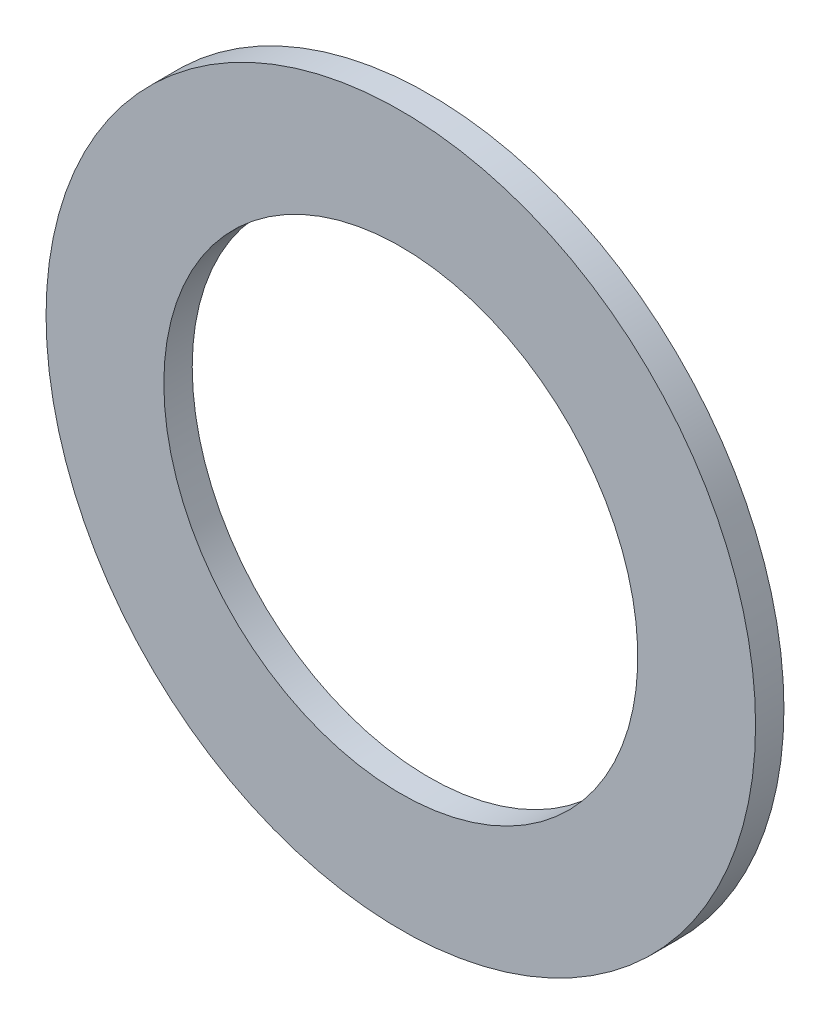
ISO-10303-21;
HEADER;
FILE_DESCRIPTION(('STEP AP214'),'2;1');
FILE_NAME('part.step','',(''),(''),'','','');
FILE_SCHEMA(('AUTOMOTIVE_DESIGN { 1 0 10303 214 1 1 1 1 }'));
ENDSEC;
DATA;
#1=APPLICATION_CONTEXT('core data for automotive mechanical design processes');
#2=APPLICATION_PROTOCOL_DEFINITION('international standard','automotive_design',2000,#1);
#3=PRODUCT_CONTEXT('',#1,'mechanical');
#4=PRODUCT('Part','Part','',(#3));
#5=PRODUCT_RELATED_PRODUCT_CATEGORY('part','',(#4));
#6=PRODUCT_DEFINITION_FORMATION('','',#4);
#7=PRODUCT_DEFINITION_CONTEXT('part definition',#1,'design');
#8=PRODUCT_DEFINITION('design','',#6,#7);
#9=PRODUCT_DEFINITION_SHAPE('','',#8);
#10=(LENGTH_UNIT() NAMED_UNIT(*) SI_UNIT(.MILLI.,.METRE.));
#11=(NAMED_UNIT(*) PLANE_ANGLE_UNIT() SI_UNIT($,.RADIAN.));
#12=(NAMED_UNIT(*) SI_UNIT($,.STERADIAN.) SOLID_ANGLE_UNIT());
#13=UNCERTAINTY_MEASURE_WITH_UNIT(LENGTH_MEASURE(1.E-05),#10,'distance_accuracy_value','');
#14=(GEOMETRIC_REPRESENTATION_CONTEXT(3) GLOBAL_UNCERTAINTY_ASSIGNED_CONTEXT((#13)) GLOBAL_UNIT_ASSIGNED_CONTEXT((#10,
#11,#12)) REPRESENTATION_CONTEXT('',''));
#15=CARTESIAN_POINT('',(0.,0.,0.));
#16=DIRECTION('',(0.,0.,1.));
#17=DIRECTION('',(1.,0.,0.));
#18=AXIS2_PLACEMENT_3D('',#15,#16,#17);
#19=CARTESIAN_POINT('',(0.,0.,-0.381));
#20=DIRECTION('',(0.,0.,1.));
#21=DIRECTION('',(1.,0.,0.));
#22=AXIS2_PLACEMENT_3D('',#19,#20,#21);
#23=PLANE('',#22);
#24=CARTESIAN_POINT('',(0.,0.,-0.381));
#25=DIRECTION('',(0.,0.,-1.));
#26=DIRECTION('',(-1.,0.,0.));
#27=AXIS2_PLACEMENT_3D('',#24,#25,#26);
#28=CIRCLE('',#27,6.3627);
#29=CARTESIAN_POINT('',(-6.3627,0.,-0.381));
#30=VERTEX_POINT('',#29);
#31=EDGE_CURVE('E25',#30,#30,#28,.F.);
#32=ORIENTED_EDGE('',*,*,#31,.T.);
#33=EDGE_LOOP('',(#32));
#34=FACE_BOUND('',#33,.T.);
#35=CARTESIAN_POINT('',(0.,0.,-0.381));
#36=DIRECTION('',(0.,0.,-1.));
#37=DIRECTION('',(-1.,0.,0.));
#38=AXIS2_PLACEMENT_3D('',#35,#36,#37);
#39=CIRCLE('',#38,9.525);
#40=CARTESIAN_POINT('',(-9.525,0.,-0.381));
#41=VERTEX_POINT('',#40);
#42=EDGE_CURVE('E16',#41,#41,#39,.F.);
#43=ORIENTED_EDGE('',*,*,#42,.F.);
#44=EDGE_LOOP('',(#43));
#45=FACE_BOUND('',#44,.T.);
#46=ADVANCED_FACE('F13',(#34,#45),#23,.F.);
#47=CARTESIAN_POINT('',(0.,0.,0.381));
#48=DIRECTION('',(0.,0.,-1.));
#49=DIRECTION('',(-1.,0.,0.));
#50=AXIS2_PLACEMENT_3D('',#47,#48,#49);
#51=CYLINDRICAL_SURFACE('',#50,9.525);
#52=ORIENTED_EDGE('',*,*,#42,.T.);
#53=EDGE_LOOP('',(#52));
#54=FACE_BOUND('',#53,.T.);
#55=CARTESIAN_POINT('',(0.,0.,0.381));
#56=DIRECTION('',(0.,0.,-1.));
#57=DIRECTION('',(-1.,0.,0.));
#58=AXIS2_PLACEMENT_3D('',#55,#56,#57);
#59=CIRCLE('',#58,9.525);
#60=CARTESIAN_POINT('',(-9.525,0.,0.381));
#61=VERTEX_POINT('',#60);
#62=EDGE_CURVE('E20',#61,#61,#59,.F.);
#63=ORIENTED_EDGE('',*,*,#62,.F.);
#64=EDGE_LOOP('',(#63));
#65=FACE_BOUND('',#64,.T.);
#66=ADVANCED_FACE('F33',(#54,#65),#51,.T.);
#67=CARTESIAN_POINT('',(0.,0.,0.381));
#68=DIRECTION('',(0.,0.,-1.));
#69=DIRECTION('',(-1.,0.,0.));
#70=AXIS2_PLACEMENT_3D('',#67,#68,#69);
#71=CYLINDRICAL_SURFACE('',#70,6.3627);
#72=CARTESIAN_POINT('',(0.,0.,0.381));
#73=DIRECTION('',(0.,0.,-1.));
#74=DIRECTION('',(-1.,0.,0.));
#75=AXIS2_PLACEMENT_3D('',#72,#73,#74);
#76=CIRCLE('',#75,6.3627);
#77=CARTESIAN_POINT('',(-6.3627,0.,0.381));
#78=VERTEX_POINT('',#77);
#79=EDGE_CURVE('E9',#78,#78,#76,.T.);
#80=ORIENTED_EDGE('',*,*,#79,.F.);
#81=EDGE_LOOP('',(#80));
#82=FACE_BOUND('',#81,.T.);
#83=ORIENTED_EDGE('',*,*,#31,.F.);
#84=EDGE_LOOP('',(#83));
#85=FACE_BOUND('',#84,.T.);
#86=ADVANCED_FACE('F41',(#82,#85),#71,.F.);
#87=CARTESIAN_POINT('',(0.,0.,0.381));
#88=DIRECTION('',(0.,0.,1.));
#89=DIRECTION('',(1.,0.,0.));
#90=AXIS2_PLACEMENT_3D('',#87,#88,#89);
#91=PLANE('',#90);
#92=ORIENTED_EDGE('',*,*,#79,.T.);
#93=EDGE_LOOP('',(#92));
#94=FACE_BOUND('',#93,.T.);
#95=ORIENTED_EDGE('',*,*,#62,.T.);
#96=EDGE_LOOP('',(#95));
#97=FACE_BOUND('',#96,.T.);
#98=ADVANCED_FACE('F42',(#94,#97),#91,.T.);
#99=CLOSED_SHELL('',(#46,#66,#86,#98));
#100=MANIFOLD_SOLID_BREP('B1',#99);
#101=ADVANCED_BREP_SHAPE_REPRESENTATION('',(#18,#100),#14);
#102=SHAPE_DEFINITION_REPRESENTATION(#9,#101);
ENDSEC;
END-ISO-10303-21;
